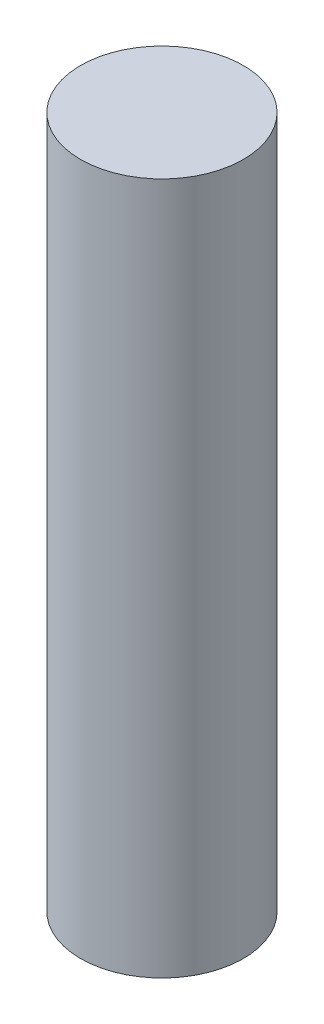
ISO-10303-21;
HEADER;
FILE_DESCRIPTION(('STEP AP214'),'2;1');
FILE_NAME('part.step','',(''),(''),'','','');
FILE_SCHEMA(('AUTOMOTIVE_DESIGN { 1 0 10303 214 1 1 1 1 }'));
ENDSEC;
DATA;
#1=APPLICATION_CONTEXT('core data for automotive mechanical design processes');
#2=APPLICATION_PROTOCOL_DEFINITION('international standard','automotive_design',2000,#1);
#3=PRODUCT_CONTEXT('',#1,'mechanical');
#4=PRODUCT('Part','Part','',(#3));
#5=PRODUCT_RELATED_PRODUCT_CATEGORY('part','',(#4));
#6=PRODUCT_DEFINITION_FORMATION('','',#4);
#7=PRODUCT_DEFINITION_CONTEXT('part definition',#1,'design');
#8=PRODUCT_DEFINITION('design','',#6,#7);
#9=PRODUCT_DEFINITION_SHAPE('','',#8);
#10=(LENGTH_UNIT() NAMED_UNIT(*) SI_UNIT(.MILLI.,.METRE.));
#11=(NAMED_UNIT(*) PLANE_ANGLE_UNIT() SI_UNIT($,.RADIAN.));
#12=(NAMED_UNIT(*) SI_UNIT($,.STERADIAN.) SOLID_ANGLE_UNIT());
#13=UNCERTAINTY_MEASURE_WITH_UNIT(LENGTH_MEASURE(1.E-05),#10,'distance_accuracy_value','');
#14=(GEOMETRIC_REPRESENTATION_CONTEXT(3) GLOBAL_UNCERTAINTY_ASSIGNED_CONTEXT((#13)) GLOBAL_UNIT_ASSIGNED_CONTEXT((#10,
#11,#12)) REPRESENTATION_CONTEXT('',''));
#15=CARTESIAN_POINT('',(0.,0.,0.));
#16=DIRECTION('',(0.,0.,1.));
#17=DIRECTION('',(1.,0.,0.));
#18=AXIS2_PLACEMENT_3D('',#15,#16,#17);
#19=CARTESIAN_POINT('',(0.,17.,0.));
#20=DIRECTION('',(0.,-1.,0.));
#21=DIRECTION('',(0.,0.,-1.));
#22=AXIS2_PLACEMENT_3D('',#19,#20,#21);
#23=CYLINDRICAL_SURFACE('',#22,2.);
#24=CARTESIAN_POINT('',(0.,17.,0.));
#25=DIRECTION('',(0.,1.,0.));
#26=DIRECTION('',(0.,0.,1.));
#27=AXIS2_PLACEMENT_3D('',#24,#25,#26);
#28=CIRCLE('',#27,2.);
#29=CARTESIAN_POINT('',(0.,17.,2.));
#30=VERTEX_POINT('',#29);
#31=EDGE_CURVE('E10',#30,#30,#28,.T.);
#32=ORIENTED_EDGE('',*,*,#31,.F.);
#33=EDGE_LOOP('',(#32));
#34=FACE_BOUND('',#33,.T.);
#35=CARTESIAN_POINT('',(0.,0.,0.));
#36=DIRECTION('',(0.,1.,0.));
#37=DIRECTION('',(0.,0.,1.));
#38=AXIS2_PLACEMENT_3D('',#35,#36,#37);
#39=CIRCLE('',#38,2.);
#40=CARTESIAN_POINT('',(0.,0.,2.));
#41=VERTEX_POINT('',#40);
#42=EDGE_CURVE('E35',#41,#41,#39,.T.);
#43=ORIENTED_EDGE('',*,*,#42,.T.);
#44=EDGE_LOOP('',(#43));
#45=FACE_BOUND('',#44,.T.);
#46=ADVANCED_FACE('F32',(#34,#45),#23,.T.);
#47=CARTESIAN_POINT('',(0.,17.,0.));
#48=DIRECTION('',(0.,1.,0.));
#49=DIRECTION('',(0.,0.,1.));
#50=AXIS2_PLACEMENT_3D('',#47,#48,#49);
#51=PLANE('',#50);
#52=ORIENTED_EDGE('',*,*,#31,.T.);
#53=EDGE_LOOP('',(#52));
#54=FACE_BOUND('',#53,.T.);
#55=ADVANCED_FACE('F47',(#54),#51,.T.);
#56=CARTESIAN_POINT('',(0.,0.,0.));
#57=DIRECTION('',(0.,1.,0.));
#58=DIRECTION('',(0.,0.,1.));
#59=AXIS2_PLACEMENT_3D('',#56,#57,#58);
#60=PLANE('',#59);
#61=ORIENTED_EDGE('',*,*,#42,.F.);
#62=EDGE_LOOP('',(#61));
#63=FACE_BOUND('',#62,.T.);
#64=ADVANCED_FACE('F45',(#63),#60,.F.);
#65=CLOSED_SHELL('',(#46,#55,#64));
#66=MANIFOLD_SOLID_BREP('B2',#65);
#67=ADVANCED_BREP_SHAPE_REPRESENTATION('',(#18,#66),#14);
#68=SHAPE_DEFINITION_REPRESENTATION(#9,#67);
ENDSEC;
END-ISO-10303-21;
